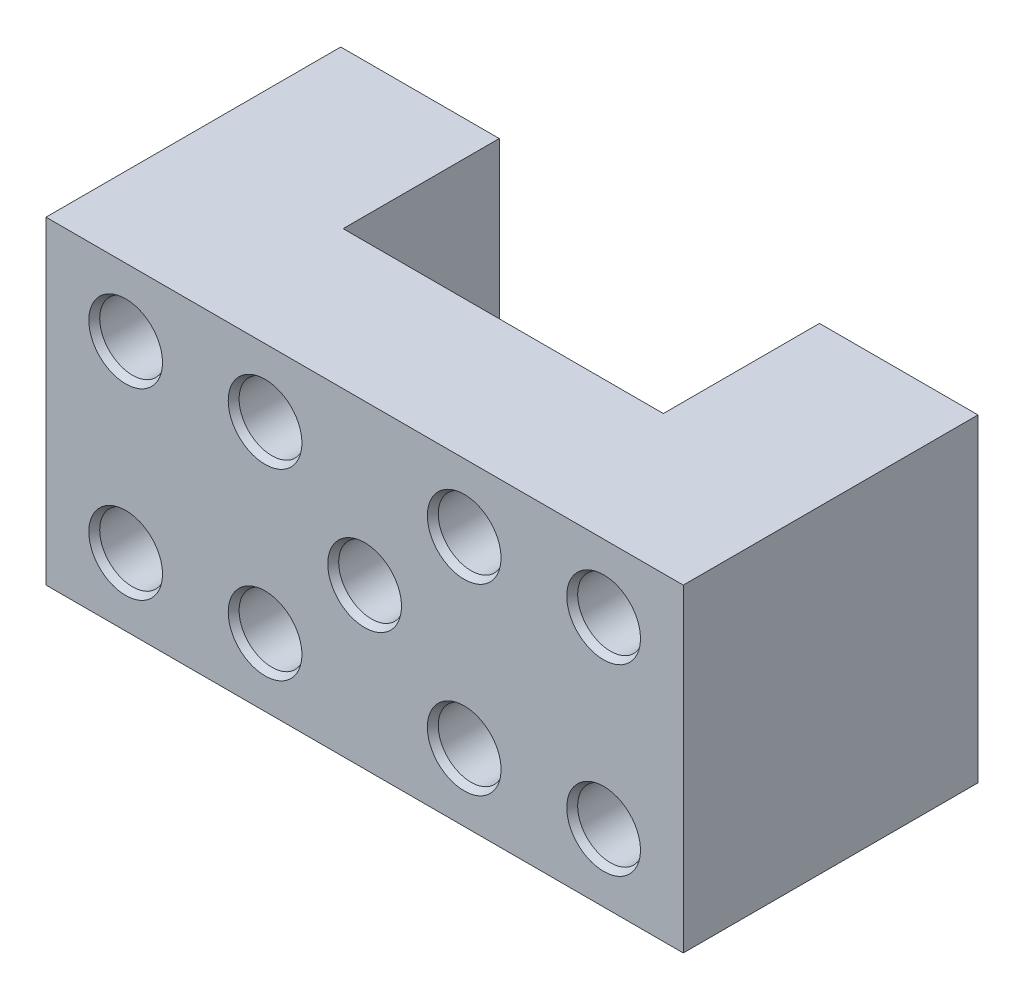
ISO-10303-21;
HEADER;
FILE_DESCRIPTION(('STEP AP214'),'2;1');
FILE_NAME('part.step','',(''),(''),'','','');
FILE_SCHEMA(('AUTOMOTIVE_DESIGN { 1 0 10303 214 1 1 1 1 }'));
ENDSEC;
DATA;
#1=APPLICATION_CONTEXT('core data for automotive mechanical design processes');
#2=APPLICATION_PROTOCOL_DEFINITION('international standard','automotive_design',2000,#1);
#3=PRODUCT_CONTEXT('',#1,'mechanical');
#4=PRODUCT('Part','Part','',(#3));
#5=PRODUCT_RELATED_PRODUCT_CATEGORY('part','',(#4));
#6=PRODUCT_DEFINITION_FORMATION('','',#4);
#7=PRODUCT_DEFINITION_CONTEXT('part definition',#1,'design');
#8=PRODUCT_DEFINITION('design','',#6,#7);
#9=PRODUCT_DEFINITION_SHAPE('','',#8);
#10=(LENGTH_UNIT() NAMED_UNIT(*) SI_UNIT(.MILLI.,.METRE.));
#11=(NAMED_UNIT(*) PLANE_ANGLE_UNIT() SI_UNIT($,.RADIAN.));
#12=(NAMED_UNIT(*) SI_UNIT($,.STERADIAN.) SOLID_ANGLE_UNIT());
#13=UNCERTAINTY_MEASURE_WITH_UNIT(LENGTH_MEASURE(1.E-05),#10,'distance_accuracy_value','');
#14=(GEOMETRIC_REPRESENTATION_CONTEXT(3) GLOBAL_UNCERTAINTY_ASSIGNED_CONTEXT((#13)) GLOBAL_UNIT_ASSIGNED_CONTEXT((#10,
#11,#12)) REPRESENTATION_CONTEXT('',''));
#15=CARTESIAN_POINT('',(0.,0.,0.));
#16=DIRECTION('',(0.,0.,1.));
#17=DIRECTION('',(1.,0.,0.));
#18=AXIS2_PLACEMENT_3D('',#15,#16,#17);
#19=CARTESIAN_POINT('',(-11.4121037463977,40.,-37.));
#20=DIRECTION('',(0.,0.,1.));
#21=DIRECTION('',(1.,0.,0.));
#22=AXIS2_PLACEMENT_3D('',#19,#20,#21);
#23=PLANE('',#22);
#24=CARTESIAN_POINT('',(-21.3121037463977,8.50000000000001,-37.));
#25=DIRECTION('',(0.,0.,1.));
#26=DIRECTION('',(1.,0.,0.));
#27=AXIS2_PLACEMENT_3D('',#24,#25,#26);
#28=CIRCLE('',#27,4.125);
#29=CARTESIAN_POINT('',(-17.1871037463977,8.50000000000001,-37.));
#30=VERTEX_POINT('',#29);
#31=EDGE_CURVE('E376',#30,#30,#28,.T.);
#32=ORIENTED_EDGE('',*,*,#31,.T.);
#33=EDGE_LOOP('',(#32));
#34=FACE_BOUND('',#33,.T.);
#35=CARTESIAN_POINT('',(-21.3121037463977,31.5,-37.));
#36=DIRECTION('',(0.,0.,1.));
#37=DIRECTION('',(1.,0.,0.));
#38=AXIS2_PLACEMENT_3D('',#35,#36,#37);
#39=CIRCLE('',#38,4.125);
#40=CARTESIAN_POINT('',(-17.1871037463977,31.5,-37.));
#41=VERTEX_POINT('',#40);
#42=EDGE_CURVE('E171',#41,#41,#39,.T.);
#43=ORIENTED_EDGE('',*,*,#42,.T.);
#44=EDGE_LOOP('',(#43));
#45=FACE_BOUND('',#44,.T.);
#46=DIRECTION('',(-1.,0.,0.));
#47=VECTOR('',#46,1.);
#48=CARTESIAN_POINT('',(-11.4121037463977,0.,-37.));
#49=LINE('',#48,#47);
#50=CARTESIAN_POINT('',(-11.4121037463977,0.,-37.));
#51=VERTEX_POINT('',#50);
#52=CARTESIAN_POINT('',(-31.3121037463977,0.,-37.));
#53=VERTEX_POINT('',#52);
#54=EDGE_CURVE('E133',#51,#53,#49,.T.);
#55=ORIENTED_EDGE('',*,*,#54,.T.);
#56=DIRECTION('',(0.,-1.,0.));
#57=VECTOR('',#56,1.);
#58=CARTESIAN_POINT('',(-31.3121037463977,40.,-37.));
#59=LINE('',#58,#57);
#60=CARTESIAN_POINT('',(-31.3121037463977,40.,-37.));
#61=VERTEX_POINT('',#60);
#62=EDGE_CURVE('E161',#61,#53,#59,.T.);
#63=ORIENTED_EDGE('',*,*,#62,.F.);
#64=DIRECTION('',(-1.,0.,0.));
#65=VECTOR('',#64,1.);
#66=CARTESIAN_POINT('',(-11.4121037463977,40.,-37.));
#67=LINE('',#66,#65);
#68=CARTESIAN_POINT('',(-11.4121037463977,40.,-37.));
#69=VERTEX_POINT('',#68);
#70=EDGE_CURVE('E148',#69,#61,#67,.T.);
#71=ORIENTED_EDGE('',*,*,#70,.F.);
#72=DIRECTION('',(0.,-1.,0.));
#73=VECTOR('',#72,1.);
#74=CARTESIAN_POINT('',(-11.4121037463977,40.,-37.));
#75=LINE('',#74,#73);
#76=EDGE_CURVE('E129',#69,#51,#75,.T.);
#77=ORIENTED_EDGE('',*,*,#76,.T.);
#78=EDGE_LOOP('',(#55,#63,#71,#77));
#79=FACE_BOUND('',#78,.T.);
#80=ADVANCED_FACE('F35',(#34,#45,#79),#23,.F.);
#81=CARTESIAN_POINT('',(-31.3121037463977,40.,-37.));
#82=DIRECTION('',(1.,0.,0.));
#83=DIRECTION('',(0.,0.,-1.));
#84=AXIS2_PLACEMENT_3D('',#81,#82,#83);
#85=PLANE('',#84);
#86=DIRECTION('',(0.,0.,1.));
#87=VECTOR('',#86,1.);
#88=CARTESIAN_POINT('',(-31.3121037463977,0.,-37.));
#89=LINE('',#88,#87);
#90=CARTESIAN_POINT('',(-31.3121037463977,0.,0.));
#91=VERTEX_POINT('',#90);
#92=EDGE_CURVE('E136',#53,#91,#89,.T.);
#93=ORIENTED_EDGE('',*,*,#92,.T.);
#94=DIRECTION('',(0.,-1.,0.));
#95=VECTOR('',#94,1.);
#96=CARTESIAN_POINT('',(-31.3121037463977,40.,0.));
#97=LINE('',#96,#95);
#98=CARTESIAN_POINT('',(-31.3121037463977,40.,0.));
#99=VERTEX_POINT('',#98);
#100=EDGE_CURVE('E158',#99,#91,#97,.T.);
#101=ORIENTED_EDGE('',*,*,#100,.F.);
#102=DIRECTION('',(0.,0.,1.));
#103=VECTOR('',#102,1.);
#104=CARTESIAN_POINT('',(-31.3121037463977,40.,-37.));
#105=LINE('',#104,#103);
#106=EDGE_CURVE('E96',#61,#99,#105,.T.);
#107=ORIENTED_EDGE('',*,*,#106,.F.);
#108=ORIENTED_EDGE('',*,*,#62,.T.);
#109=EDGE_LOOP('',(#93,#101,#107,#108));
#110=FACE_BOUND('',#109,.T.);
#111=ADVANCED_FACE('F245',(#110),#85,.F.);
#112=CARTESIAN_POINT('',(-31.3121037463977,40.,0.));
#113=DIRECTION('',(0.,0.,-1.));
#114=DIRECTION('',(-1.,0.,0.));
#115=AXIS2_PLACEMENT_3D('',#112,#113,#114);
#116=PLANE('',#115);
#117=CARTESIAN_POINT('',(21.1878962536023,8.50000000000001,0.));
#118=DIRECTION('',(0.,0.,-1.));
#119=DIRECTION('',(-1.,0.,0.));
#120=AXIS2_PLACEMENT_3D('',#117,#118,#119);
#121=CIRCLE('',#120,4.625);
#122=CARTESIAN_POINT('',(16.5628962536023,8.50000000000001,0.));
#123=VERTEX_POINT('',#122);
#124=EDGE_CURVE('E205',#123,#123,#121,.T.);
#125=ORIENTED_EDGE('',*,*,#124,.T.);
#126=EDGE_LOOP('',(#125));
#127=FACE_BOUND('',#126,.T.);
#128=CARTESIAN_POINT('',(38.6878962536023,8.50000000000001,0.));
#129=DIRECTION('',(0.,0.,-1.));
#130=DIRECTION('',(-1.,0.,0.));
#131=AXIS2_PLACEMENT_3D('',#128,#129,#130);
#132=CIRCLE('',#131,4.625);
#133=CARTESIAN_POINT('',(34.0628962536023,8.50000000000001,0.));
#134=VERTEX_POINT('',#133);
#135=EDGE_CURVE('E202',#134,#134,#132,.T.);
#136=ORIENTED_EDGE('',*,*,#135,.T.);
#137=EDGE_LOOP('',(#136));
#138=FACE_BOUND('',#137,.T.);
#139=CARTESIAN_POINT('',(38.6878962536023,31.5,0.));
#140=DIRECTION('',(0.,0.,-1.));
#141=DIRECTION('',(-1.,0.,0.));
#142=AXIS2_PLACEMENT_3D('',#139,#140,#141);
#143=CIRCLE('',#142,4.625);
#144=CARTESIAN_POINT('',(34.0628962536023,31.5,0.));
#145=VERTEX_POINT('',#144);
#146=EDGE_CURVE('E199',#145,#145,#143,.T.);
#147=ORIENTED_EDGE('',*,*,#146,.T.);
#148=EDGE_LOOP('',(#147));
#149=FACE_BOUND('',#148,.T.);
#150=CARTESIAN_POINT('',(21.1878962536023,31.5,0.));
#151=DIRECTION('',(0.,0.,-1.));
#152=DIRECTION('',(-1.,0.,0.));
#153=AXIS2_PLACEMENT_3D('',#150,#151,#152);
#154=CIRCLE('',#153,4.625);
#155=CARTESIAN_POINT('',(16.5628962536023,31.5,0.));
#156=VERTEX_POINT('',#155);
#157=EDGE_CURVE('E196',#156,#156,#154,.T.);
#158=ORIENTED_EDGE('',*,*,#157,.T.);
#159=EDGE_LOOP('',(#158));
#160=FACE_BOUND('',#159,.T.);
#161=CARTESIAN_POINT('',(-3.81210374639769,31.5,0.));
#162=DIRECTION('',(0.,0.,-1.));
#163=DIRECTION('',(-1.,0.,0.));
#164=AXIS2_PLACEMENT_3D('',#161,#162,#163);
#165=CIRCLE('',#164,4.625);
#166=CARTESIAN_POINT('',(-8.43710374639769,31.5,0.));
#167=VERTEX_POINT('',#166);
#168=EDGE_CURVE('E193',#167,#167,#165,.T.);
#169=ORIENTED_EDGE('',*,*,#168,.T.);
#170=EDGE_LOOP('',(#169));
#171=FACE_BOUND('',#170,.T.);
#172=CARTESIAN_POINT('',(8.68789625360231,20.,0.));
#173=DIRECTION('',(0.,0.,-1.));
#174=DIRECTION('',(-1.,0.,0.));
#175=AXIS2_PLACEMENT_3D('',#172,#173,#174);
#176=CIRCLE('',#175,4.625);
#177=CARTESIAN_POINT('',(4.06289625360231,20.,0.));
#178=VERTEX_POINT('',#177);
#179=EDGE_CURVE('E190',#178,#178,#176,.T.);
#180=ORIENTED_EDGE('',*,*,#179,.T.);
#181=EDGE_LOOP('',(#180));
#182=FACE_BOUND('',#181,.T.);
#183=CARTESIAN_POINT('',(-3.81210374639769,8.50000000000001,0.));
#184=DIRECTION('',(0.,0.,-1.));
#185=DIRECTION('',(-1.,0.,0.));
#186=AXIS2_PLACEMENT_3D('',#183,#184,#185);
#187=CIRCLE('',#186,4.625);
#188=CARTESIAN_POINT('',(-8.43710374639769,8.50000000000001,0.));
#189=VERTEX_POINT('',#188);
#190=EDGE_CURVE('E187',#189,#189,#187,.T.);
#191=ORIENTED_EDGE('',*,*,#190,.T.);
#192=EDGE_LOOP('',(#191));
#193=FACE_BOUND('',#192,.T.);
#194=CARTESIAN_POINT('',(-21.3121037463977,8.50000000000001,0.));
#195=DIRECTION('',(0.,0.,-1.));
#196=DIRECTION('',(-1.,0.,0.));
#197=AXIS2_PLACEMENT_3D('',#194,#195,#196);
#198=CIRCLE('',#197,4.625);
#199=CARTESIAN_POINT('',(-25.9371037463977,8.50000000000001,0.));
#200=VERTEX_POINT('',#199);
#201=EDGE_CURVE('E184',#200,#200,#198,.T.);
#202=ORIENTED_EDGE('',*,*,#201,.T.);
#203=EDGE_LOOP('',(#202));
#204=FACE_BOUND('',#203,.T.);
#205=CARTESIAN_POINT('',(-21.3121037463977,31.5,0.));
#206=DIRECTION('',(0.,0.,-1.));
#207=DIRECTION('',(-1.,0.,0.));
#208=AXIS2_PLACEMENT_3D('',#205,#206,#207);
#209=CIRCLE('',#208,4.625);
#210=CARTESIAN_POINT('',(-25.9371037463977,31.5,0.));
#211=VERTEX_POINT('',#210);
#212=EDGE_CURVE('E181',#211,#211,#209,.T.);
#213=ORIENTED_EDGE('',*,*,#212,.T.);
#214=EDGE_LOOP('',(#213));
#215=FACE_BOUND('',#214,.T.);
#216=DIRECTION('',(1.,0.,0.));
#217=VECTOR('',#216,1.);
#218=CARTESIAN_POINT('',(-31.3121037463977,0.,0.));
#219=LINE('',#218,#217);
#220=CARTESIAN_POINT('',(48.6878962536023,0.,0.));
#221=VERTEX_POINT('',#220);
#222=EDGE_CURVE('E139',#91,#221,#219,.T.);
#223=ORIENTED_EDGE('',*,*,#222,.T.);
#224=DIRECTION('',(0.,-1.,0.));
#225=VECTOR('',#224,1.);
#226=CARTESIAN_POINT('',(48.6878962536023,40.,0.));
#227=LINE('',#226,#225);
#228=CARTESIAN_POINT('',(48.6878962536023,40.,0.));
#229=VERTEX_POINT('',#228);
#230=EDGE_CURVE('E155',#229,#221,#227,.T.);
#231=ORIENTED_EDGE('',*,*,#230,.F.);
#232=DIRECTION('',(1.,0.,0.));
#233=VECTOR('',#232,1.);
#234=CARTESIAN_POINT('',(-31.3121037463977,40.,0.));
#235=LINE('',#234,#233);
#236=EDGE_CURVE('E367',#99,#229,#235,.T.);
#237=ORIENTED_EDGE('',*,*,#236,.F.);
#238=ORIENTED_EDGE('',*,*,#100,.T.);
#239=EDGE_LOOP('',(#223,#231,#237,#238));
#240=FACE_BOUND('',#239,.T.);
#241=ADVANCED_FACE('F251',(#127,#138,#149,#160,#171,#182,#193,#204,#215,#240),#116,.F.);
#242=CARTESIAN_POINT('',(48.6878962536023,40.,0.));
#243=DIRECTION('',(-1.,0.,0.));
#244=DIRECTION('',(0.,0.,1.));
#245=AXIS2_PLACEMENT_3D('',#242,#243,#244);
#246=PLANE('',#245);
#247=DIRECTION('',(0.,0.,-1.));
#248=VECTOR('',#247,1.);
#249=CARTESIAN_POINT('',(48.6878962536023,0.,0.));
#250=LINE('',#249,#248);
#251=CARTESIAN_POINT('',(48.6878962536023,0.,-37.));
#252=VERTEX_POINT('',#251);
#253=EDGE_CURVE('E141',#221,#252,#250,.T.);
#254=ORIENTED_EDGE('',*,*,#253,.T.);
#255=DIRECTION('',(0.,-1.,0.));
#256=VECTOR('',#255,1.);
#257=CARTESIAN_POINT('',(48.6878962536023,40.,-37.));
#258=LINE('',#257,#256);
#259=CARTESIAN_POINT('',(48.6878962536023,40.,-37.));
#260=VERTEX_POINT('',#259);
#261=EDGE_CURVE('E152',#260,#252,#258,.T.);
#262=ORIENTED_EDGE('',*,*,#261,.F.);
#263=DIRECTION('',(0.,0.,-1.));
#264=VECTOR('',#263,1.);
#265=CARTESIAN_POINT('',(48.6878962536023,40.,0.));
#266=LINE('',#265,#264);
#267=EDGE_CURVE('E363',#229,#260,#266,.T.);
#268=ORIENTED_EDGE('',*,*,#267,.F.);
#269=ORIENTED_EDGE('',*,*,#230,.T.);
#270=EDGE_LOOP('',(#254,#262,#268,#269));
#271=FACE_BOUND('',#270,.T.);
#272=ADVANCED_FACE('F333',(#271),#246,.F.);
#273=CARTESIAN_POINT('',(48.6878962536023,40.,-37.));
#274=DIRECTION('',(0.,0.,1.));
#275=DIRECTION('',(1.,0.,0.));
#276=AXIS2_PLACEMENT_3D('',#273,#274,#275);
#277=PLANE('',#276);
#278=CARTESIAN_POINT('',(38.6878962536023,8.50000000000001,-37.));
#279=DIRECTION('',(0.,0.,1.));
#280=DIRECTION('',(1.,0.,0.));
#281=AXIS2_PLACEMENT_3D('',#278,#279,#280);
#282=CIRCLE('',#281,4.125);
#283=CARTESIAN_POINT('',(42.8128962536023,8.50000000000001,-37.));
#284=VERTEX_POINT('',#283);
#285=EDGE_CURVE('E378',#284,#284,#282,.T.);
#286=ORIENTED_EDGE('',*,*,#285,.T.);
#287=EDGE_LOOP('',(#286));
#288=FACE_BOUND('',#287,.T.);
#289=CARTESIAN_POINT('',(38.6878962536023,31.5,-37.));
#290=DIRECTION('',(0.,0.,1.));
#291=DIRECTION('',(1.,0.,0.));
#292=AXIS2_PLACEMENT_3D('',#289,#290,#291);
#293=CIRCLE('',#292,4.125);
#294=CARTESIAN_POINT('',(42.8128962536023,31.5,-37.));
#295=VERTEX_POINT('',#294);
#296=EDGE_CURVE('E375',#295,#295,#293,.T.);
#297=ORIENTED_EDGE('',*,*,#296,.T.);
#298=EDGE_LOOP('',(#297));
#299=FACE_BOUND('',#298,.T.);
#300=DIRECTION('',(-1.,0.,0.));
#301=VECTOR('',#300,1.);
#302=CARTESIAN_POINT('',(48.6878962536023,0.,-37.));
#303=LINE('',#302,#301);
#304=CARTESIAN_POINT('',(28.7878962536023,0.,-37.));
#305=VERTEX_POINT('',#304);
#306=EDGE_CURVE('E143',#252,#305,#303,.T.);
#307=ORIENTED_EDGE('',*,*,#306,.T.);
#308=DIRECTION('',(0.,-1.,0.));
#309=VECTOR('',#308,1.);
#310=CARTESIAN_POINT('',(28.7878962536023,40.,-37.));
#311=LINE('',#310,#309);
#312=CARTESIAN_POINT('',(28.7878962536023,40.,-37.));
#313=VERTEX_POINT('',#312);
#314=EDGE_CURVE('E124',#313,#305,#311,.T.);
#315=ORIENTED_EDGE('',*,*,#314,.F.);
#316=DIRECTION('',(-1.,0.,0.));
#317=VECTOR('',#316,1.);
#318=CARTESIAN_POINT('',(48.6878962536023,40.,-37.));
#319=LINE('',#318,#317);
#320=EDGE_CURVE('E115',#260,#313,#319,.T.);
#321=ORIENTED_EDGE('',*,*,#320,.F.);
#322=ORIENTED_EDGE('',*,*,#261,.T.);
#323=EDGE_LOOP('',(#307,#315,#321,#322));
#324=FACE_BOUND('',#323,.T.);
#325=ADVANCED_FACE('F330',(#288,#299,#324),#277,.F.);
#326=CARTESIAN_POINT('',(28.7878962536023,40.,-37.));
#327=DIRECTION('',(1.,0.,0.));
#328=DIRECTION('',(0.,0.,-1.));
#329=AXIS2_PLACEMENT_3D('',#326,#327,#328);
#330=PLANE('',#329);
#331=DIRECTION('',(0.,0.,1.));
#332=VECTOR('',#331,1.);
#333=CARTESIAN_POINT('',(28.7878962536023,0.,-37.));
#334=LINE('',#333,#332);
#335=CARTESIAN_POINT('',(28.7878962536023,0.,-17.4));
#336=VERTEX_POINT('',#335);
#337=EDGE_CURVE('E123',#305,#336,#334,.T.);
#338=ORIENTED_EDGE('',*,*,#337,.T.);
#339=DIRECTION('',(0.,-1.,0.));
#340=VECTOR('',#339,1.);
#341=CARTESIAN_POINT('',(28.7878962536023,40.,-17.4));
#342=LINE('',#341,#340);
#343=CARTESIAN_POINT('',(28.7878962536023,40.,-17.4));
#344=VERTEX_POINT('',#343);
#345=EDGE_CURVE('E120',#344,#336,#342,.T.);
#346=ORIENTED_EDGE('',*,*,#345,.F.);
#347=DIRECTION('',(0.,0.,1.));
#348=VECTOR('',#347,1.);
#349=CARTESIAN_POINT('',(28.7878962536023,40.,-37.));
#350=LINE('',#349,#348);
#351=EDGE_CURVE('E109',#313,#344,#350,.T.);
#352=ORIENTED_EDGE('',*,*,#351,.F.);
#353=ORIENTED_EDGE('',*,*,#314,.T.);
#354=EDGE_LOOP('',(#338,#346,#352,#353));
#355=FACE_BOUND('',#354,.T.);
#356=ADVANCED_FACE('F121',(#355),#330,.F.);
#357=CARTESIAN_POINT('',(28.7878962536023,40.,-17.4));
#358=DIRECTION('',(0.,0.,1.));
#359=DIRECTION('',(1.,0.,0.));
#360=AXIS2_PLACEMENT_3D('',#357,#358,#359);
#361=PLANE('',#360);
#362=CARTESIAN_POINT('',(8.68789625360231,20.,-17.4));
#363=DIRECTION('',(0.,0.,1.));
#364=DIRECTION('',(1.,0.,0.));
#365=AXIS2_PLACEMENT_3D('',#362,#363,#364);
#366=CIRCLE('',#365,4.125);
#367=CARTESIAN_POINT('',(12.8128962536023,20.,-17.4));
#368=VERTEX_POINT('',#367);
#369=EDGE_CURVE('E166',#368,#368,#366,.T.);
#370=ORIENTED_EDGE('',*,*,#369,.T.);
#371=EDGE_LOOP('',(#370));
#372=FACE_BOUND('',#371,.T.);
#373=CARTESIAN_POINT('',(-3.81210374639769,8.50000000000001,-17.4));
#374=DIRECTION('',(0.,0.,1.));
#375=DIRECTION('',(1.,0.,0.));
#376=AXIS2_PLACEMENT_3D('',#373,#374,#375);
#377=CIRCLE('',#376,4.125);
#378=CARTESIAN_POINT('',(0.31289625360231,8.50000000000001,-17.4));
#379=VERTEX_POINT('',#378);
#380=EDGE_CURVE('E174',#379,#379,#377,.T.);
#381=ORIENTED_EDGE('',*,*,#380,.T.);
#382=EDGE_LOOP('',(#381));
#383=FACE_BOUND('',#382,.T.);
#384=CARTESIAN_POINT('',(21.1878962536023,8.50000000000001,-17.4));
#385=DIRECTION('',(0.,0.,1.));
#386=DIRECTION('',(1.,0.,0.));
#387=AXIS2_PLACEMENT_3D('',#384,#385,#386);
#388=CIRCLE('',#387,4.12500000000001);
#389=CARTESIAN_POINT('',(25.3128962536023,8.50000000000001,-17.4));
#390=VERTEX_POINT('',#389);
#391=EDGE_CURVE('E170',#390,#390,#388,.T.);
#392=ORIENTED_EDGE('',*,*,#391,.T.);
#393=EDGE_LOOP('',(#392));
#394=FACE_BOUND('',#393,.T.);
#395=CARTESIAN_POINT('',(21.1878962536023,31.5,-17.4));
#396=DIRECTION('',(0.,0.,1.));
#397=DIRECTION('',(1.,0.,0.));
#398=AXIS2_PLACEMENT_3D('',#395,#396,#397);
#399=CIRCLE('',#398,4.12500000000001);
#400=CARTESIAN_POINT('',(25.3128962536023,31.5,-17.4));
#401=VERTEX_POINT('',#400);
#402=EDGE_CURVE('E167',#401,#401,#399,.T.);
#403=ORIENTED_EDGE('',*,*,#402,.T.);
#404=EDGE_LOOP('',(#403));
#405=FACE_BOUND('',#404,.T.);
#406=CARTESIAN_POINT('',(-3.81210374639769,31.5,-17.4));
#407=DIRECTION('',(0.,0.,1.));
#408=DIRECTION('',(1.,0.,0.));
#409=AXIS2_PLACEMENT_3D('',#406,#407,#408);
#410=CIRCLE('',#409,4.125);
#411=CARTESIAN_POINT('',(0.312896253602312,31.5,-17.4));
#412=VERTEX_POINT('',#411);
#413=EDGE_CURVE('E137',#412,#412,#410,.T.);
#414=ORIENTED_EDGE('',*,*,#413,.T.);
#415=EDGE_LOOP('',(#414));
#416=FACE_BOUND('',#415,.T.);
#417=DIRECTION('',(-1.,0.,0.));
#418=VECTOR('',#417,1.);
#419=CARTESIAN_POINT('',(28.7878962536023,0.,-17.4));
#420=LINE('',#419,#418);
#421=CARTESIAN_POINT('',(-11.4121037463977,0.,-17.4));
#422=VERTEX_POINT('',#421);
#423=EDGE_CURVE('E81',#336,#422,#420,.T.);
#424=ORIENTED_EDGE('',*,*,#423,.T.);
#425=DIRECTION('',(0.,-1.,0.));
#426=VECTOR('',#425,1.);
#427=CARTESIAN_POINT('',(-11.4121037463977,40.,-17.4));
#428=LINE('',#427,#426);
#429=CARTESIAN_POINT('',(-11.4121037463977,40.,-17.4));
#430=VERTEX_POINT('',#429);
#431=EDGE_CURVE('E125',#430,#422,#428,.T.);
#432=ORIENTED_EDGE('',*,*,#431,.F.);
#433=DIRECTION('',(-1.,0.,0.));
#434=VECTOR('',#433,1.);
#435=CARTESIAN_POINT('',(28.7878962536023,40.,-17.4));
#436=LINE('',#435,#434);
#437=EDGE_CURVE('E113',#344,#430,#436,.T.);
#438=ORIENTED_EDGE('',*,*,#437,.F.);
#439=ORIENTED_EDGE('',*,*,#345,.T.);
#440=EDGE_LOOP('',(#424,#432,#438,#439));
#441=FACE_BOUND('',#440,.T.);
#442=ADVANCED_FACE('F127',(#372,#383,#394,#405,#416,#441),#361,.F.);
#443=CARTESIAN_POINT('',(-11.4121037463977,40.,-17.4));
#444=DIRECTION('',(-1.,0.,0.));
#445=DIRECTION('',(0.,0.,1.));
#446=AXIS2_PLACEMENT_3D('',#443,#444,#445);
#447=PLANE('',#446);
#448=DIRECTION('',(0.,0.,-1.));
#449=VECTOR('',#448,1.);
#450=CARTESIAN_POINT('',(-11.4121037463977,0.,-17.4));
#451=LINE('',#450,#449);
#452=EDGE_CURVE('E87',#422,#51,#451,.T.);
#453=ORIENTED_EDGE('',*,*,#452,.T.);
#454=ORIENTED_EDGE('',*,*,#76,.F.);
#455=DIRECTION('',(0.,0.,-1.));
#456=VECTOR('',#455,1.);
#457=CARTESIAN_POINT('',(-11.4121037463977,40.,-17.4));
#458=LINE('',#457,#456);
#459=EDGE_CURVE('E52',#430,#69,#458,.T.);
#460=ORIENTED_EDGE('',*,*,#459,.F.);
#461=ORIENTED_EDGE('',*,*,#431,.T.);
#462=EDGE_LOOP('',(#453,#454,#460,#461));
#463=FACE_BOUND('',#462,.T.);
#464=ADVANCED_FACE('F295',(#463),#447,.F.);
#465=CARTESIAN_POINT('',(0.,40.,0.));
#466=DIRECTION('',(0.,1.,0.));
#467=DIRECTION('',(0.,0.,1.));
#468=AXIS2_PLACEMENT_3D('',#465,#466,#467);
#469=PLANE('',#468);
#470=ORIENTED_EDGE('',*,*,#70,.T.);
#471=ORIENTED_EDGE('',*,*,#106,.T.);
#472=ORIENTED_EDGE('',*,*,#236,.T.);
#473=ORIENTED_EDGE('',*,*,#267,.T.);
#474=ORIENTED_EDGE('',*,*,#320,.T.);
#475=ORIENTED_EDGE('',*,*,#351,.T.);
#476=ORIENTED_EDGE('',*,*,#437,.T.);
#477=ORIENTED_EDGE('',*,*,#459,.T.);
#478=EDGE_LOOP('',(#470,#471,#472,#473,#474,#475,#476,#477));
#479=FACE_BOUND('',#478,.T.);
#480=ADVANCED_FACE('F111',(#479),#469,.T.);
#481=CARTESIAN_POINT('',(0.,0.,0.));
#482=DIRECTION('',(0.,1.,0.));
#483=DIRECTION('',(0.,0.,1.));
#484=AXIS2_PLACEMENT_3D('',#481,#482,#483);
#485=PLANE('',#484);
#486=ORIENTED_EDGE('',*,*,#54,.F.);
#487=ORIENTED_EDGE('',*,*,#452,.F.);
#488=ORIENTED_EDGE('',*,*,#423,.F.);
#489=ORIENTED_EDGE('',*,*,#337,.F.);
#490=ORIENTED_EDGE('',*,*,#306,.F.);
#491=ORIENTED_EDGE('',*,*,#253,.F.);
#492=ORIENTED_EDGE('',*,*,#222,.F.);
#493=ORIENTED_EDGE('',*,*,#92,.F.);
#494=EDGE_LOOP('',(#486,#487,#488,#489,#490,#491,#492,#493));
#495=FACE_BOUND('',#494,.T.);
#496=ADVANCED_FACE('F308',(#495),#485,.F.);
#497=CARTESIAN_POINT('',(-3.81210374639769,31.5,-37.));
#498=DIRECTION('',(0.,0.,1.));
#499=DIRECTION('',(1.,0.,0.));
#500=AXIS2_PLACEMENT_3D('',#497,#498,#499);
#501=CYLINDRICAL_SURFACE('',#500,4.125);
#502=CARTESIAN_POINT('',(-3.81210374639769,31.5,-0.866025403784436));
#503=DIRECTION('',(0.,0.,-1.));
#504=DIRECTION('',(-1.,0.,0.));
#505=AXIS2_PLACEMENT_3D('',#502,#503,#504);
#506=CIRCLE('',#505,4.125);
#507=CARTESIAN_POINT('',(-7.93710374639769,31.5,-0.866025403784436));
#508=VERTEX_POINT('',#507);
#509=EDGE_CURVE('E217',#508,#508,#506,.F.);
#510=ORIENTED_EDGE('',*,*,#509,.T.);
#511=EDGE_LOOP('',(#510));
#512=FACE_BOUND('',#511,.T.);
#513=ORIENTED_EDGE('',*,*,#413,.F.);
#514=EDGE_LOOP('',(#513));
#515=FACE_BOUND('',#514,.T.);
#516=ADVANCED_FACE('F305',(#512,#515),#501,.F.);
#517=CARTESIAN_POINT('',(21.1878962536023,31.5,-37.));
#518=DIRECTION('',(0.,0.,1.));
#519=DIRECTION('',(1.,0.,0.));
#520=AXIS2_PLACEMENT_3D('',#517,#518,#519);
#521=CYLINDRICAL_SURFACE('',#520,4.12500000000001);
#522=CARTESIAN_POINT('',(21.1878962536023,31.5,-0.866025403784429));
#523=DIRECTION('',(0.,0.,-1.));
#524=DIRECTION('',(-1.,0.,0.));
#525=AXIS2_PLACEMENT_3D('',#522,#523,#524);
#526=CIRCLE('',#525,4.12500000000001);
#527=CARTESIAN_POINT('',(17.0628962536023,31.5,-0.866025403784429));
#528=VERTEX_POINT('',#527);
#529=EDGE_CURVE('E214',#528,#528,#526,.F.);
#530=ORIENTED_EDGE('',*,*,#529,.T.);
#531=EDGE_LOOP('',(#530));
#532=FACE_BOUND('',#531,.T.);
#533=ORIENTED_EDGE('',*,*,#402,.F.);
#534=EDGE_LOOP('',(#533));
#535=FACE_BOUND('',#534,.T.);
#536=ADVANCED_FACE('F307',(#532,#535),#521,.F.);
#537=CARTESIAN_POINT('',(21.1878962536023,8.50000000000001,-37.));
#538=DIRECTION('',(0.,0.,1.));
#539=DIRECTION('',(1.,0.,0.));
#540=AXIS2_PLACEMENT_3D('',#537,#538,#539);
#541=CYLINDRICAL_SURFACE('',#540,4.12500000000001);
#542=CARTESIAN_POINT('',(21.1878962536023,8.50000000000001,-0.866025403784429));
#543=DIRECTION('',(0.,0.,-1.));
#544=DIRECTION('',(-1.,0.,0.));
#545=AXIS2_PLACEMENT_3D('',#542,#543,#544);
#546=CIRCLE('',#545,4.12500000000001);
#547=CARTESIAN_POINT('',(17.0628962536023,8.50000000000001,-0.866025403784429));
#548=VERTEX_POINT('',#547);
#549=EDGE_CURVE('E163',#548,#548,#546,.F.);
#550=ORIENTED_EDGE('',*,*,#549,.T.);
#551=EDGE_LOOP('',(#550));
#552=FACE_BOUND('',#551,.T.);
#553=ORIENTED_EDGE('',*,*,#391,.F.);
#554=EDGE_LOOP('',(#553));
#555=FACE_BOUND('',#554,.T.);
#556=ADVANCED_FACE('F315',(#552,#555),#541,.F.);
#557=CARTESIAN_POINT('',(-3.81210374639769,8.50000000000001,-37.));
#558=DIRECTION('',(0.,0.,1.));
#559=DIRECTION('',(1.,0.,0.));
#560=AXIS2_PLACEMENT_3D('',#557,#558,#559);
#561=CYLINDRICAL_SURFACE('',#560,4.125);
#562=CARTESIAN_POINT('',(-3.81210374639769,8.50000000000001,-0.866025403784443));
#563=DIRECTION('',(0.,0.,-1.));
#564=DIRECTION('',(-1.,0.,0.));
#565=AXIS2_PLACEMENT_3D('',#562,#563,#564);
#566=CIRCLE('',#565,4.125);
#567=CARTESIAN_POINT('',(-7.93710374639769,8.50000000000001,-0.866025403784443));
#568=VERTEX_POINT('',#567);
#569=EDGE_CURVE('E223',#568,#568,#566,.F.);
#570=ORIENTED_EDGE('',*,*,#569,.T.);
#571=EDGE_LOOP('',(#570));
#572=FACE_BOUND('',#571,.T.);
#573=ORIENTED_EDGE('',*,*,#380,.F.);
#574=EDGE_LOOP('',(#573));
#575=FACE_BOUND('',#574,.T.);
#576=ADVANCED_FACE('F289',(#572,#575),#561,.F.);
#577=CARTESIAN_POINT('',(8.68789625360231,20.,-37.));
#578=DIRECTION('',(0.,0.,1.));
#579=DIRECTION('',(1.,0.,0.));
#580=AXIS2_PLACEMENT_3D('',#577,#578,#579);
#581=CYLINDRICAL_SURFACE('',#580,4.125);
#582=CARTESIAN_POINT('',(8.68789625360231,20.,-0.866025403784443));
#583=DIRECTION('',(0.,0.,-1.));
#584=DIRECTION('',(-1.,0.,0.));
#585=AXIS2_PLACEMENT_3D('',#582,#583,#584);
#586=CIRCLE('',#585,4.125);
#587=CARTESIAN_POINT('',(4.56289625360231,20.,-0.866025403784443));
#588=VERTEX_POINT('',#587);
#589=EDGE_CURVE('E220',#588,#588,#586,.F.);
#590=ORIENTED_EDGE('',*,*,#589,.T.);
#591=EDGE_LOOP('',(#590));
#592=FACE_BOUND('',#591,.T.);
#593=ORIENTED_EDGE('',*,*,#369,.F.);
#594=EDGE_LOOP('',(#593));
#595=FACE_BOUND('',#594,.T.);
#596=ADVANCED_FACE('F285',(#592,#595),#581,.F.);
#597=CARTESIAN_POINT('',(38.6878962536023,31.5,-37.));
#598=DIRECTION('',(0.,0.,1.));
#599=DIRECTION('',(1.,0.,0.));
#600=AXIS2_PLACEMENT_3D('',#597,#598,#599);
#601=CYLINDRICAL_SURFACE('',#600,4.125);
#602=CARTESIAN_POINT('',(38.6878962536023,31.5,-0.86602540378445));
#603=DIRECTION('',(0.,0.,-1.));
#604=DIRECTION('',(-1.,0.,0.));
#605=AXIS2_PLACEMENT_3D('',#602,#603,#604);
#606=CIRCLE('',#605,4.125);
#607=CARTESIAN_POINT('',(34.5628962536023,31.5,-0.86602540378445));
#608=VERTEX_POINT('',#607);
#609=EDGE_CURVE('E211',#608,#608,#606,.F.);
#610=ORIENTED_EDGE('',*,*,#609,.T.);
#611=EDGE_LOOP('',(#610));
#612=FACE_BOUND('',#611,.T.);
#613=ORIENTED_EDGE('',*,*,#296,.F.);
#614=EDGE_LOOP('',(#613));
#615=FACE_BOUND('',#614,.T.);
#616=ADVANCED_FACE('F288',(#612,#615),#601,.F.);
#617=CARTESIAN_POINT('',(38.6878962536023,8.50000000000001,-37.));
#618=DIRECTION('',(0.,0.,1.));
#619=DIRECTION('',(1.,0.,0.));
#620=AXIS2_PLACEMENT_3D('',#617,#618,#619);
#621=CYLINDRICAL_SURFACE('',#620,4.125);
#622=CARTESIAN_POINT('',(38.6878962536023,8.50000000000001,-0.866025403784443));
#623=DIRECTION('',(0.,0.,-1.));
#624=DIRECTION('',(-1.,0.,0.));
#625=AXIS2_PLACEMENT_3D('',#622,#623,#624);
#626=CIRCLE('',#625,4.125);
#627=CARTESIAN_POINT('',(34.5628962536023,8.50000000000001,-0.866025403784443));
#628=VERTEX_POINT('',#627);
#629=EDGE_CURVE('E208',#628,#628,#626,.F.);
#630=ORIENTED_EDGE('',*,*,#629,.T.);
#631=EDGE_LOOP('',(#630));
#632=FACE_BOUND('',#631,.T.);
#633=ORIENTED_EDGE('',*,*,#285,.F.);
#634=EDGE_LOOP('',(#633));
#635=FACE_BOUND('',#634,.T.);
#636=ADVANCED_FACE('F386',(#632,#635),#621,.F.);
#637=CARTESIAN_POINT('',(-21.3121037463977,31.5,-37.));
#638=DIRECTION('',(0.,0.,1.));
#639=DIRECTION('',(1.,0.,0.));
#640=AXIS2_PLACEMENT_3D('',#637,#638,#639);
#641=CYLINDRICAL_SURFACE('',#640,4.125);
#642=CARTESIAN_POINT('',(-21.3121037463977,31.5,-0.86602540378445));
#643=DIRECTION('',(0.,0.,-1.));
#644=DIRECTION('',(-1.,0.,0.));
#645=AXIS2_PLACEMENT_3D('',#642,#643,#644);
#646=CIRCLE('',#645,4.125);
#647=CARTESIAN_POINT('',(-25.4371037463977,31.5,-0.86602540378445));
#648=VERTEX_POINT('',#647);
#649=EDGE_CURVE('E11',#648,#648,#646,.F.);
#650=ORIENTED_EDGE('',*,*,#649,.T.);
#651=EDGE_LOOP('',(#650));
#652=FACE_BOUND('',#651,.T.);
#653=ORIENTED_EDGE('',*,*,#42,.F.);
#654=EDGE_LOOP('',(#653));
#655=FACE_BOUND('',#654,.T.);
#656=ADVANCED_FACE('F322',(#652,#655),#641,.F.);
#657=CARTESIAN_POINT('',(-21.3121037463977,8.50000000000001,-37.));
#658=DIRECTION('',(0.,0.,1.));
#659=DIRECTION('',(1.,0.,0.));
#660=AXIS2_PLACEMENT_3D('',#657,#658,#659);
#661=CYLINDRICAL_SURFACE('',#660,4.125);
#662=CARTESIAN_POINT('',(-21.3121037463977,8.50000000000001,-0.866025403784443));
#663=DIRECTION('',(0.,0.,-1.));
#664=DIRECTION('',(-1.,0.,0.));
#665=AXIS2_PLACEMENT_3D('',#662,#663,#664);
#666=CIRCLE('',#665,4.125);
#667=CARTESIAN_POINT('',(-25.4371037463977,8.50000000000001,-0.866025403784443));
#668=VERTEX_POINT('',#667);
#669=EDGE_CURVE('E44',#668,#668,#666,.F.);
#670=ORIENTED_EDGE('',*,*,#669,.T.);
#671=EDGE_LOOP('',(#670));
#672=FACE_BOUND('',#671,.T.);
#673=ORIENTED_EDGE('',*,*,#31,.F.);
#674=EDGE_LOOP('',(#673));
#675=FACE_BOUND('',#674,.T.);
#676=ADVANCED_FACE('F228',(#672,#675),#661,.F.);
#677=CARTESIAN_POINT('',(21.1878962536023,8.50000000000001,-0.866025403784429));
#678=DIRECTION('',(0.,0.,1.));
#679=DIRECTION('',(1.,0.,0.));
#680=AXIS2_PLACEMENT_3D('',#677,#678,#679);
#681=CONICAL_SURFACE('',#680,4.12500000000001,0.523598775598296);
#682=ORIENTED_EDGE('',*,*,#124,.F.);
#683=EDGE_LOOP('',(#682));
#684=FACE_BOUND('',#683,.T.);
#685=ORIENTED_EDGE('',*,*,#549,.F.);
#686=EDGE_LOOP('',(#685));
#687=FACE_BOUND('',#686,.T.);
#688=ADVANCED_FACE('F257',(#684,#687),#681,.F.);
#689=CARTESIAN_POINT('',(38.6878962536023,8.50000000000001,-0.866025403784443));
#690=DIRECTION('',(0.,0.,1.));
#691=DIRECTION('',(1.,0.,0.));
#692=AXIS2_PLACEMENT_3D('',#689,#690,#691);
#693=CONICAL_SURFACE('',#692,4.125,0.523598775598296);
#694=ORIENTED_EDGE('',*,*,#135,.F.);
#695=EDGE_LOOP('',(#694));
#696=FACE_BOUND('',#695,.T.);
#697=ORIENTED_EDGE('',*,*,#629,.F.);
#698=EDGE_LOOP('',(#697));
#699=FACE_BOUND('',#698,.T.);
#700=ADVANCED_FACE('F260',(#696,#699),#693,.F.);
#701=CARTESIAN_POINT('',(38.6878962536023,31.5,-0.86602540378445));
#702=DIRECTION('',(0.,0.,1.));
#703=DIRECTION('',(1.,0.,0.));
#704=AXIS2_PLACEMENT_3D('',#701,#702,#703);
#705=CONICAL_SURFACE('',#704,4.125,0.523598775598293);
#706=ORIENTED_EDGE('',*,*,#146,.F.);
#707=EDGE_LOOP('',(#706));
#708=FACE_BOUND('',#707,.T.);
#709=ORIENTED_EDGE('',*,*,#609,.F.);
#710=EDGE_LOOP('',(#709));
#711=FACE_BOUND('',#710,.T.);
#712=ADVANCED_FACE('F264',(#708,#711),#705,.F.);
#713=CARTESIAN_POINT('',(21.1878962536023,31.5,-0.866025403784429));
#714=DIRECTION('',(0.,0.,1.));
#715=DIRECTION('',(1.,0.,0.));
#716=AXIS2_PLACEMENT_3D('',#713,#714,#715);
#717=CONICAL_SURFACE('',#716,4.12500000000001,0.523598775598296);
#718=ORIENTED_EDGE('',*,*,#157,.F.);
#719=EDGE_LOOP('',(#718));
#720=FACE_BOUND('',#719,.T.);
#721=ORIENTED_EDGE('',*,*,#529,.F.);
#722=EDGE_LOOP('',(#721));
#723=FACE_BOUND('',#722,.T.);
#724=ADVANCED_FACE('F268',(#720,#723),#717,.F.);
#725=CARTESIAN_POINT('',(-3.81210374639769,31.5,-0.866025403784436));
#726=DIRECTION('',(0.,0.,1.));
#727=DIRECTION('',(1.,0.,0.));
#728=AXIS2_PLACEMENT_3D('',#725,#726,#727);
#729=CONICAL_SURFACE('',#728,4.125,0.523598775598297);
#730=ORIENTED_EDGE('',*,*,#168,.F.);
#731=EDGE_LOOP('',(#730));
#732=FACE_BOUND('',#731,.T.);
#733=ORIENTED_EDGE('',*,*,#509,.F.);
#734=EDGE_LOOP('',(#733));
#735=FACE_BOUND('',#734,.T.);
#736=ADVANCED_FACE('F272',(#732,#735),#729,.F.);
#737=CARTESIAN_POINT('',(8.68789625360231,20.,-0.866025403784443));
#738=DIRECTION('',(0.,0.,1.));
#739=DIRECTION('',(1.,0.,0.));
#740=AXIS2_PLACEMENT_3D('',#737,#738,#739);
#741=CONICAL_SURFACE('',#740,4.125,0.523598775598294);
#742=ORIENTED_EDGE('',*,*,#179,.F.);
#743=EDGE_LOOP('',(#742));
#744=FACE_BOUND('',#743,.T.);
#745=ORIENTED_EDGE('',*,*,#589,.F.);
#746=EDGE_LOOP('',(#745));
#747=FACE_BOUND('',#746,.T.);
#748=ADVANCED_FACE('F240',(#744,#747),#741,.F.);
#749=CARTESIAN_POINT('',(-3.81210374639769,8.50000000000001,-0.866025403784443));
#750=DIRECTION('',(0.,0.,1.));
#751=DIRECTION('',(1.,0.,0.));
#752=AXIS2_PLACEMENT_3D('',#749,#750,#751);
#753=CONICAL_SURFACE('',#752,4.125,0.523598775598295);
#754=ORIENTED_EDGE('',*,*,#190,.F.);
#755=EDGE_LOOP('',(#754));
#756=FACE_BOUND('',#755,.T.);
#757=ORIENTED_EDGE('',*,*,#569,.F.);
#758=EDGE_LOOP('',(#757));
#759=FACE_BOUND('',#758,.T.);
#760=ADVANCED_FACE('F233',(#756,#759),#753,.F.);
#761=CARTESIAN_POINT('',(-21.3121037463977,8.50000000000001,-0.866025403784443));
#762=DIRECTION('',(0.,0.,1.));
#763=DIRECTION('',(1.,0.,0.));
#764=AXIS2_PLACEMENT_3D('',#761,#762,#763);
#765=CONICAL_SURFACE('',#764,4.125,0.523598775598296);
#766=ORIENTED_EDGE('',*,*,#201,.F.);
#767=EDGE_LOOP('',(#766));
#768=FACE_BOUND('',#767,.T.);
#769=ORIENTED_EDGE('',*,*,#669,.F.);
#770=EDGE_LOOP('',(#769));
#771=FACE_BOUND('',#770,.T.);
#772=ADVANCED_FACE('F231',(#768,#771),#765,.F.);
#773=CARTESIAN_POINT('',(-21.3121037463977,31.5,-0.86602540378445));
#774=DIRECTION('',(0.,0.,1.));
#775=DIRECTION('',(1.,0.,0.));
#776=AXIS2_PLACEMENT_3D('',#773,#774,#775);
#777=CONICAL_SURFACE('',#776,4.125,0.523598775598293);
#778=ORIENTED_EDGE('',*,*,#212,.F.);
#779=EDGE_LOOP('',(#778));
#780=FACE_BOUND('',#779,.T.);
#781=ORIENTED_EDGE('',*,*,#649,.F.);
#782=EDGE_LOOP('',(#781));
#783=FACE_BOUND('',#782,.T.);
#784=ADVANCED_FACE('F37',(#780,#783),#777,.F.);
#785=CLOSED_SHELL('',(#80,#111,#241,#272,#325,#356,#442,#464,#480,#496,#516,#536,#556,#576,#596,
#616,#636,#656,#676,#688,#700,#712,#724,#736,#748,#760,#772,#784));
#786=MANIFOLD_SOLID_BREP('B2',#785);
#787=ADVANCED_BREP_SHAPE_REPRESENTATION('',(#18,#786),#14);
#788=SHAPE_DEFINITION_REPRESENTATION(#9,#787);
ENDSEC;
END-ISO-10303-21;
